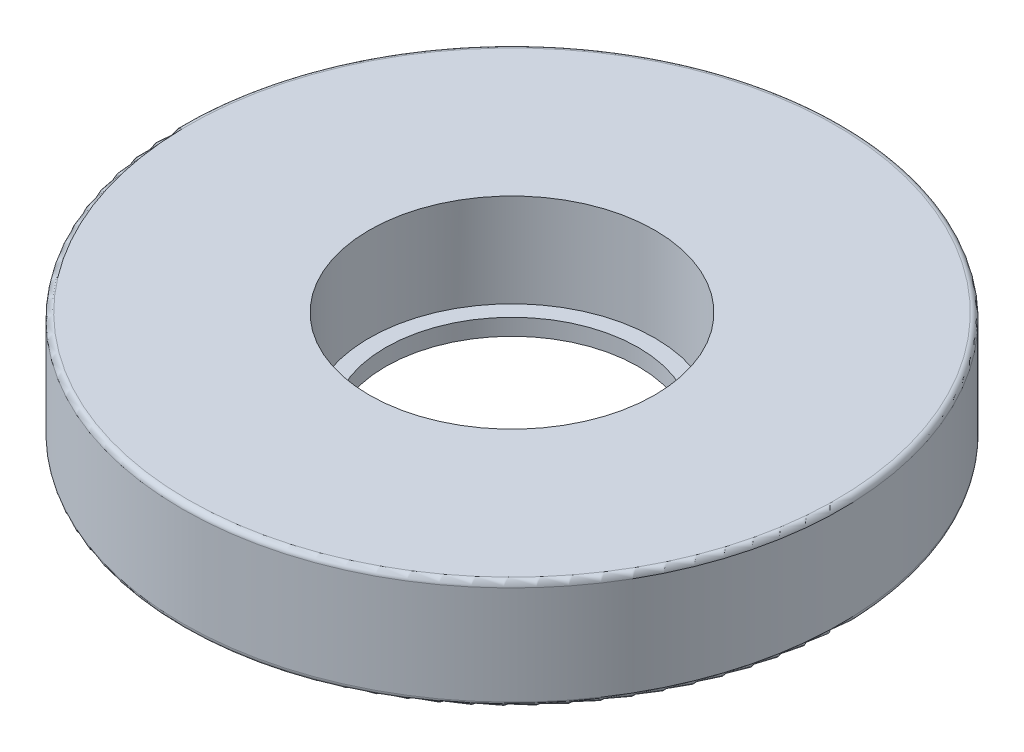
ISO-10303-21;
HEADER;
FILE_DESCRIPTION(('STEP AP214'),'2;1');
FILE_NAME('part.step','',(''),(''),'','','');
FILE_SCHEMA(('AUTOMOTIVE_DESIGN { 1 0 10303 214 1 1 1 1 }'));
ENDSEC;
DATA;
#1=APPLICATION_CONTEXT('core data for automotive mechanical design processes');
#2=APPLICATION_PROTOCOL_DEFINITION('international standard','automotive_design',2000,#1);
#3=PRODUCT_CONTEXT('',#1,'mechanical');
#4=PRODUCT('Part','Part','',(#3));
#5=PRODUCT_RELATED_PRODUCT_CATEGORY('part','',(#4));
#6=PRODUCT_DEFINITION_FORMATION('','',#4);
#7=PRODUCT_DEFINITION_CONTEXT('part definition',#1,'design');
#8=PRODUCT_DEFINITION('design','',#6,#7);
#9=PRODUCT_DEFINITION_SHAPE('','',#8);
#10=(LENGTH_UNIT() NAMED_UNIT(*) SI_UNIT(.MILLI.,.METRE.));
#11=(NAMED_UNIT(*) PLANE_ANGLE_UNIT() SI_UNIT($,.RADIAN.));
#12=(NAMED_UNIT(*) SI_UNIT($,.STERADIAN.) SOLID_ANGLE_UNIT());
#13=UNCERTAINTY_MEASURE_WITH_UNIT(LENGTH_MEASURE(1.E-05),#10,'distance_accuracy_value','');
#14=(GEOMETRIC_REPRESENTATION_CONTEXT(3) GLOBAL_UNCERTAINTY_ASSIGNED_CONTEXT((#13)) GLOBAL_UNIT_ASSIGNED_CONTEXT((#10,
#11,#12)) REPRESENTATION_CONTEXT('',''));
#15=CARTESIAN_POINT('',(0.,0.,0.));
#16=DIRECTION('',(0.,0.,1.));
#17=DIRECTION('',(1.,0.,0.));
#18=AXIS2_PLACEMENT_3D('',#15,#16,#17);
#19=CARTESIAN_POINT('',(0.,20.,0.));
#20=DIRECTION('',(0.,-1.,0.));
#21=DIRECTION('',(0.,0.,-1.));
#22=AXIS2_PLACEMENT_3D('',#19,#20,#21);
#23=CYLINDRICAL_SURFACE('',#22,26.);
#24=CARTESIAN_POINT('',(0.,20.,0.));
#25=DIRECTION('',(0.,1.,0.));
#26=DIRECTION('',(0.,0.,1.));
#27=AXIS2_PLACEMENT_3D('',#24,#25,#26);
#28=CIRCLE('',#27,26.);
#29=CARTESIAN_POINT('',(0.,20.,26.));
#30=VERTEX_POINT('',#29);
#31=EDGE_CURVE('E52',#30,#30,#28,.T.);
#32=ORIENTED_EDGE('',*,*,#31,.T.);
#33=EDGE_LOOP('',(#32));
#34=FACE_BOUND('',#33,.T.);
#35=CARTESIAN_POINT('',(0.,3.,0.));
#36=DIRECTION('',(0.,-1.,0.));
#37=DIRECTION('',(0.,0.,-1.));
#38=AXIS2_PLACEMENT_3D('',#35,#36,#37);
#39=CIRCLE('',#38,26.);
#40=CARTESIAN_POINT('',(0.,3.,-26.));
#41=VERTEX_POINT('',#40);
#42=EDGE_CURVE('E55',#41,#41,#39,.T.);
#43=ORIENTED_EDGE('',*,*,#42,.T.);
#44=EDGE_LOOP('',(#43));
#45=FACE_BOUND('',#44,.T.);
#46=ADVANCED_FACE('F32',(#34,#45),#23,.F.);
#47=CARTESIAN_POINT('',(0.,20.,0.));
#48=DIRECTION('',(0.,1.,0.));
#49=DIRECTION('',(0.,0.,1.));
#50=AXIS2_PLACEMENT_3D('',#47,#48,#49);
#51=PLANE('',#50);
#52=CARTESIAN_POINT('',(0.,20.,0.));
#53=DIRECTION('',(0.,1.,0.));
#54=DIRECTION('',(0.,0.,1.));
#55=AXIS2_PLACEMENT_3D('',#52,#53,#54);
#56=CIRCLE('',#55,59.);
#57=CARTESIAN_POINT('',(0.,20.,59.));
#58=VERTEX_POINT('',#57);
#59=EDGE_CURVE('E10',#58,#58,#56,.T.);
#60=ORIENTED_EDGE('',*,*,#59,.T.);
#61=EDGE_LOOP('',(#60));
#62=FACE_BOUND('',#61,.T.);
#63=ORIENTED_EDGE('',*,*,#31,.F.);
#64=EDGE_LOOP('',(#63));
#65=FACE_BOUND('',#64,.T.);
#66=ADVANCED_FACE('F77',(#62,#65),#51,.T.);
#67=CARTESIAN_POINT('',(0.,0.,0.));
#68=DIRECTION('',(0.,1.,0.));
#69=DIRECTION('',(0.,0.,1.));
#70=AXIS2_PLACEMENT_3D('',#67,#68,#69);
#71=PLANE('',#70);
#72=CARTESIAN_POINT('',(0.,0.,0.));
#73=DIRECTION('',(0.,1.,0.));
#74=DIRECTION('',(0.,0.,1.));
#75=AXIS2_PLACEMENT_3D('',#72,#73,#74);
#76=CIRCLE('',#75,59.);
#77=CARTESIAN_POINT('',(0.,0.,59.));
#78=VERTEX_POINT('',#77);
#79=EDGE_CURVE('E39',#78,#78,#76,.F.);
#80=ORIENTED_EDGE('',*,*,#79,.T.);
#81=EDGE_LOOP('',(#80));
#82=FACE_BOUND('',#81,.T.);
#83=CARTESIAN_POINT('',(0.,0.,0.));
#84=DIRECTION('',(0.,-1.,0.));
#85=DIRECTION('',(0.,0.,-1.));
#86=AXIS2_PLACEMENT_3D('',#83,#84,#85);
#87=CIRCLE('',#86,23.);
#88=CARTESIAN_POINT('',(0.,0.,-23.));
#89=VERTEX_POINT('',#88);
#90=EDGE_CURVE('E59',#89,#89,#87,.T.);
#91=ORIENTED_EDGE('',*,*,#90,.F.);
#92=EDGE_LOOP('',(#91));
#93=FACE_BOUND('',#92,.T.);
#94=ADVANCED_FACE('F74',(#82,#93),#71,.F.);
#95=CARTESIAN_POINT('',(0.,20.,0.));
#96=DIRECTION('',(0.,-1.,0.));
#97=DIRECTION('',(0.,0.,-1.));
#98=AXIS2_PLACEMENT_3D('',#95,#96,#97);
#99=CYLINDRICAL_SURFACE('',#98,60.);
#100=CARTESIAN_POINT('',(0.,1.,0.));
#101=DIRECTION('',(0.,1.,0.));
#102=DIRECTION('',(0.,0.,1.));
#103=AXIS2_PLACEMENT_3D('',#100,#101,#102);
#104=CIRCLE('',#103,60.);
#105=CARTESIAN_POINT('',(0.,1.,60.));
#106=VERTEX_POINT('',#105);
#107=EDGE_CURVE('E43',#106,#106,#104,.T.);
#108=ORIENTED_EDGE('',*,*,#107,.T.);
#109=EDGE_LOOP('',(#108));
#110=FACE_BOUND('',#109,.T.);
#111=CARTESIAN_POINT('',(0.,19.,0.));
#112=DIRECTION('',(0.,1.,0.));
#113=DIRECTION('',(0.,0.,1.));
#114=AXIS2_PLACEMENT_3D('',#111,#112,#113);
#115=CIRCLE('',#114,60.);
#116=CARTESIAN_POINT('',(0.,19.,60.));
#117=VERTEX_POINT('',#116);
#118=EDGE_CURVE('E47',#117,#117,#115,.F.);
#119=ORIENTED_EDGE('',*,*,#118,.T.);
#120=EDGE_LOOP('',(#119));
#121=FACE_BOUND('',#120,.T.);
#122=ADVANCED_FACE('F76',(#110,#121),#99,.T.);
#123=CARTESIAN_POINT('',(0.,1.,0.));
#124=DIRECTION('',(0.,1.,0.));
#125=DIRECTION('',(0.,0.,1.));
#126=AXIS2_PLACEMENT_3D('',#123,#124,#125);
#127=TOROIDAL_SURFACE('',#126,59.,1.);
#128=ORIENTED_EDGE('',*,*,#79,.F.);
#129=EDGE_LOOP('',(#128));
#130=FACE_BOUND('',#129,.T.);
#131=ORIENTED_EDGE('',*,*,#107,.F.);
#132=EDGE_LOOP('',(#131));
#133=FACE_BOUND('',#132,.T.);
#134=ADVANCED_FACE('F83',(#130,#133),#127,.T.);
#135=CARTESIAN_POINT('',(0.,19.,0.));
#136=DIRECTION('',(0.,1.,0.));
#137=DIRECTION('',(0.,0.,1.));
#138=AXIS2_PLACEMENT_3D('',#135,#136,#137);
#139=TOROIDAL_SURFACE('',#138,59.,1.);
#140=ORIENTED_EDGE('',*,*,#118,.F.);
#141=EDGE_LOOP('',(#140));
#142=FACE_BOUND('',#141,.T.);
#143=ORIENTED_EDGE('',*,*,#59,.F.);
#144=EDGE_LOOP('',(#143));
#145=FACE_BOUND('',#144,.T.);
#146=ADVANCED_FACE('F34',(#142,#145),#139,.T.);
#147=CARTESIAN_POINT('',(0.,3.,0.));
#148=DIRECTION('',(0.,-1.,0.));
#149=DIRECTION('',(0.,0.,-1.));
#150=AXIS2_PLACEMENT_3D('',#147,#148,#149);
#151=PLANE('',#150);
#152=CARTESIAN_POINT('',(0.,3.,0.));
#153=DIRECTION('',(0.,-1.,0.));
#154=DIRECTION('',(0.,0.,-1.));
#155=AXIS2_PLACEMENT_3D('',#152,#153,#154);
#156=CIRCLE('',#155,23.);
#157=CARTESIAN_POINT('',(0.,3.,-23.));
#158=VERTEX_POINT('',#157);
#159=EDGE_CURVE('E58',#158,#158,#156,.T.);
#160=ORIENTED_EDGE('',*,*,#159,.T.);
#161=EDGE_LOOP('',(#160));
#162=FACE_BOUND('',#161,.T.);
#163=ORIENTED_EDGE('',*,*,#42,.F.);
#164=EDGE_LOOP('',(#163));
#165=FACE_BOUND('',#164,.T.);
#166=ADVANCED_FACE('F65',(#162,#165),#151,.F.);
#167=CARTESIAN_POINT('',(0.,3.,0.));
#168=DIRECTION('',(0.,-1.,0.));
#169=DIRECTION('',(0.,0.,-1.));
#170=AXIS2_PLACEMENT_3D('',#167,#168,#169);
#171=CYLINDRICAL_SURFACE('',#170,23.);
#172=ORIENTED_EDGE('',*,*,#159,.F.);
#173=EDGE_LOOP('',(#172));
#174=FACE_BOUND('',#173,.T.);
#175=ORIENTED_EDGE('',*,*,#90,.T.);
#176=EDGE_LOOP('',(#175));
#177=FACE_BOUND('',#176,.T.);
#178=ADVANCED_FACE('F68',(#174,#177),#171,.F.);
#179=CLOSED_SHELL('',(#46,#66,#94,#122,#134,#146,#166,#178));
#180=MANIFOLD_SOLID_BREP('B2',#179);
#181=ADVANCED_BREP_SHAPE_REPRESENTATION('',(#18,#180),#14);
#182=SHAPE_DEFINITION_REPRESENTATION(#9,#181);
ENDSEC;
END-ISO-10303-21;
